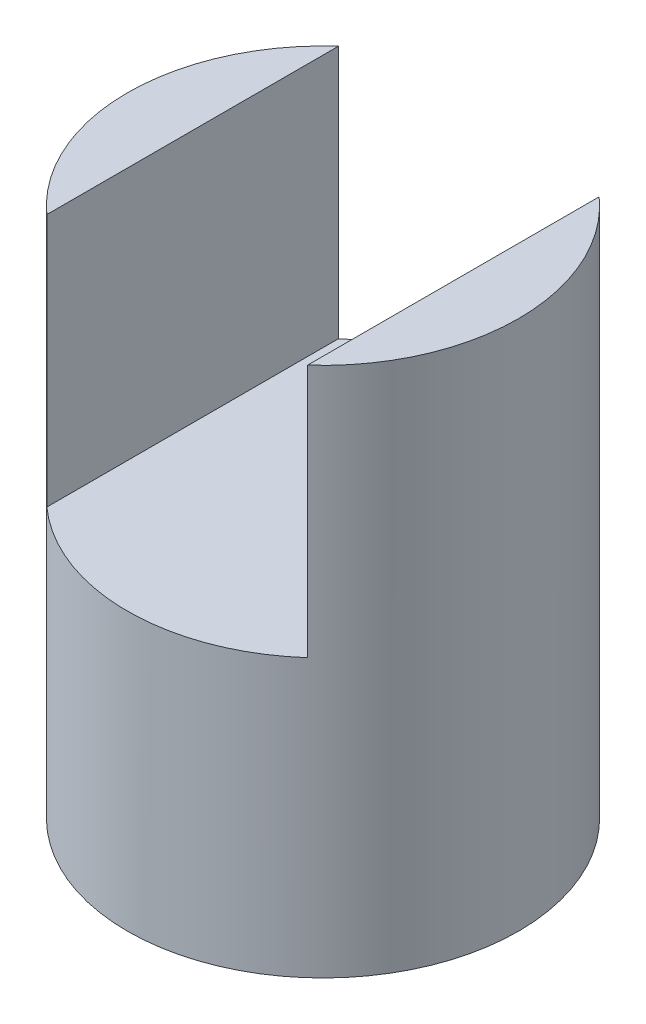
ISO-10303-21;
HEADER;
FILE_DESCRIPTION(('STEP AP214'),'2;1');
FILE_NAME('part.step','',(''),(''),'','','');
FILE_SCHEMA(('AUTOMOTIVE_DESIGN { 1 0 10303 214 1 1 1 1 }'));
ENDSEC;
DATA;
#1=APPLICATION_CONTEXT('core data for automotive mechanical design processes');
#2=APPLICATION_PROTOCOL_DEFINITION('international standard','automotive_design',2000,#1);
#3=PRODUCT_CONTEXT('',#1,'mechanical');
#4=PRODUCT('Part','Part','',(#3));
#5=PRODUCT_RELATED_PRODUCT_CATEGORY('part','',(#4));
#6=PRODUCT_DEFINITION_FORMATION('','',#4);
#7=PRODUCT_DEFINITION_CONTEXT('part definition',#1,'design');
#8=PRODUCT_DEFINITION('design','',#6,#7);
#9=PRODUCT_DEFINITION_SHAPE('','',#8);
#10=(LENGTH_UNIT() NAMED_UNIT(*) SI_UNIT(.MILLI.,.METRE.));
#11=(NAMED_UNIT(*) PLANE_ANGLE_UNIT() SI_UNIT($,.RADIAN.));
#12=(NAMED_UNIT(*) SI_UNIT($,.STERADIAN.) SOLID_ANGLE_UNIT());
#13=UNCERTAINTY_MEASURE_WITH_UNIT(LENGTH_MEASURE(1.E-05),#10,'distance_accuracy_value','');
#14=(GEOMETRIC_REPRESENTATION_CONTEXT(3) GLOBAL_UNCERTAINTY_ASSIGNED_CONTEXT((#13)) GLOBAL_UNIT_ASSIGNED_CONTEXT((#10,
#11,#12)) REPRESENTATION_CONTEXT('',''));
#15=CARTESIAN_POINT('',(0.,0.,0.));
#16=DIRECTION('',(0.,0.,1.));
#17=DIRECTION('',(1.,0.,0.));
#18=AXIS2_PLACEMENT_3D('',#15,#16,#17);
#19=CARTESIAN_POINT('',(0.,25.8375,0.));
#20=DIRECTION('',(0.,1.,0.));
#21=DIRECTION('',(0.,0.,1.));
#22=AXIS2_PLACEMENT_3D('',#19,#20,#21);
#23=PLANE('',#22);
#24=CARTESIAN_POINT('',(0.,25.8375,0.));
#25=DIRECTION('',(0.,1.,0.));
#26=DIRECTION('',(0.,0.,1.));
#27=AXIS2_PLACEMENT_3D('',#24,#25,#26);
#28=CIRCLE('',#27,9.525);
#29=CARTESIAN_POINT('',(6.35,25.8375,7.09951582856183));
#30=VERTEX_POINT('',#29);
#31=CARTESIAN_POINT('',(6.35,25.8375,-7.09951582856183));
#32=VERTEX_POINT('',#31);
#33=EDGE_CURVE('E93',#30,#32,#28,.T.);
#34=ORIENTED_EDGE('',*,*,#33,.T.);
#35=DIRECTION('',(0.,0.,1.));
#36=VECTOR('',#35,1.);
#37=CARTESIAN_POINT('',(6.35,25.8375,0.));
#38=LINE('',#37,#36);
#39=EDGE_CURVE('E114',#32,#30,#38,.T.);
#40=ORIENTED_EDGE('',*,*,#39,.T.);
#41=EDGE_LOOP('',(#34,#40));
#42=FACE_BOUND('',#41,.T.);
#43=ADVANCED_FACE('F33',(#42),#23,.T.);
#44=CARTESIAN_POINT('',(0.,12.5,0.));
#45=DIRECTION('',(0.,-1.,0.));
#46=DIRECTION('',(0.,0.,-1.));
#47=AXIS2_PLACEMENT_3D('',#44,#45,#46);
#48=CYLINDRICAL_SURFACE('',#47,9.525);
#49=CARTESIAN_POINT('',(0.,12.357,-9.525));
#50=CARTESIAN_POINT('',(-0.133261820204518,12.3569963666475,-9.52499778717324));
#51=CARTESIAN_POINT('',(-0.266563888254122,12.345923487818,-9.52217555562449));
#52=CARTESIAN_POINT('',(-0.529343744690257,12.3019932193088,-9.51119070146297));
#53=CARTESIAN_POINT('',(-0.658819388694377,12.2691238476336,-9.50302514154162));
#54=CARTESIAN_POINT('',(-0.910113998559056,12.1827258488965,-9.48225726422134));
#55=CARTESIAN_POINT('',(-1.03194208290701,12.1292223904438,-9.46966035363948));
#56=CARTESIAN_POINT('',(-1.2648940468201,12.0031644667772,-9.44136933264668));
#57=CARTESIAN_POINT('',(-1.3760174950987,11.9306092344116,-9.42567509752305));
#58=CARTESIAN_POINT('',(-1.58675101933615,11.7668900725829,-9.39252107737622));
#59=CARTESIAN_POINT('',(-1.68610299791785,11.6753995486903,-9.37503346995957));
#60=CARTESIAN_POINT('',(-1.86822958547711,11.4771059096114,-9.34044728516457));
#61=CARTESIAN_POINT('',(-1.95100227331816,11.3703010223205,-9.32334875307384));
#62=CARTESIAN_POINT('',(-2.09884319961464,11.1423954826944,-9.2911953873321));
#63=CARTESIAN_POINT('',(-2.16362112137369,11.0211010731295,-9.27617583277275));
#64=CARTESIAN_POINT('',(-2.27176615073476,10.7689020154725,-9.2502873960732));
#65=CARTESIAN_POINT('',(-2.31513678263942,10.637998953341,-9.23941783078308));
#66=CARTESIAN_POINT('',(-2.37835250981349,10.3731405174948,-9.22334627111998));
#67=CARTESIAN_POINT('',(-2.39866243654377,10.2393030320731,-9.21803247111408));
#68=CARTESIAN_POINT('',(-2.41662836661146,9.97002309996907,-9.21333954723218));
#69=CARTESIAN_POINT('',(-2.41428816103677,9.83458092566332,-9.21395943020004));
#70=CARTESIAN_POINT('',(-2.38739076502928,9.56951155489628,-9.22096341330412));
#71=CARTESIAN_POINT('',(-2.36338912946215,9.43982357872974,-9.22720336631047));
#72=CARTESIAN_POINT('',(-2.29473711857614,9.18637776145794,-9.24451447182673));
#73=CARTESIAN_POINT('',(-2.25008523709681,9.06262035363542,-9.25558597673069));
#74=CARTESIAN_POINT('',(-2.14093087229813,8.82306712932506,-9.28144392325374));
#75=CARTESIAN_POINT('',(-2.07622810930454,8.70736675526324,-9.29626755647747));
#76=CARTESIAN_POINT('',(-1.92894865586508,8.48826716968607,-9.32793871063535));
#77=CARTESIAN_POINT('',(-1.84636876065894,8.38487016890287,-9.34478659420728));
#78=CARTESIAN_POINT('',(-1.66280871445836,8.1901305575634,-9.3792135017611));
#79=CARTESIAN_POINT('',(-1.5613601861048,8.09923009813413,-9.39679948169775));
#80=CARTESIAN_POINT('',(-1.3444475965386,7.93564686589366,-9.43027626394755));
#81=CARTESIAN_POINT('',(-1.22898308445703,7.86296467936209,-9.44616701169722));
#82=CARTESIAN_POINT('',(-0.986674777222378,7.73771256101569,-9.47454545618715));
#83=CARTESIAN_POINT('',(-0.859791477125699,7.68521604560307,-9.48702068401246));
#84=CARTESIAN_POINT('',(-0.5986139778207,7.60242206293592,-9.50707191189444));
#85=CARTESIAN_POINT('',(-0.464321241001308,7.57212023188555,-9.51464887498636));
#86=CARTESIAN_POINT('',(-0.195915909627453,7.53525473046011,-9.52390673064367));
#87=CARTESIAN_POINT('',(-0.0618910228812851,7.52808913422382,-9.52573709436771));
#88=CARTESIAN_POINT('',(0.205443387655582,7.53604636527785,-9.52372202444571));
#89=CARTESIAN_POINT('',(0.338752976540512,7.55116712869411,-9.51987711636982));
#90=CARTESIAN_POINT('',(0.598769891396268,7.60277215554685,-9.50703945957878));
#91=CARTESIAN_POINT('',(0.725546957590725,7.63892660486176,-9.49812623125672));
#92=CARTESIAN_POINT('',(0.971229011334961,7.73119476548142,-9.47615771614934));
#93=CARTESIAN_POINT('',(1.09013319025598,7.78731052326324,-9.46310200468242));
#94=CARTESIAN_POINT('',(1.31907816366058,7.91906511345894,-9.4339402357856));
#95=CARTESIAN_POINT('',(1.42891937765489,7.99503919378199,-9.41778320532077));
#96=CARTESIAN_POINT('',(1.63450689029486,8.16392668154675,-9.38428900787904));
#97=CARTESIAN_POINT('',(1.73025068219546,8.25684309504475,-9.36695163181757));
#98=CARTESIAN_POINT('',(1.90741706643183,8.45977543520778,-9.33251037232561));
#99=CARTESIAN_POINT('',(1.98841691250713,8.57016394499783,-9.31542344364784));
#100=CARTESIAN_POINT('',(2.13074406616557,8.80332042926154,-9.28390484638266));
#101=CARTESIAN_POINT('',(2.19207224073659,8.92608785784664,-9.26947306078733));
#102=CARTESIAN_POINT('',(2.2928565349253,9.17986539617864,-9.24505944093763));
#103=CARTESIAN_POINT('',(2.33244205362674,9.31082145798145,-9.23505135072841));
#104=CARTESIAN_POINT('',(2.38895238323824,9.57782346217126,-9.22059641802187));
#105=CARTESIAN_POINT('',(2.40588230956493,9.71386824843918,-9.21614832014627));
#106=CARTESIAN_POINT('',(2.41632821996475,9.98287903357174,-9.21341450434409));
#107=CARTESIAN_POINT('',(2.41052059135574,10.1158173732972,-9.21495075943575));
#108=CARTESIAN_POINT('',(2.37720836550568,10.3787528499133,-9.22359992925301));
#109=CARTESIAN_POINT('',(2.34970422719062,10.5087500489553,-9.2307127260232));
#110=CARTESIAN_POINT('',(2.27415369262479,10.761355069886,-9.24961298012439));
#111=CARTESIAN_POINT('',(2.22623737784595,10.884004167804,-9.26137080203738));
#112=CARTESIAN_POINT('',(2.11132510428059,11.1196110418672,-9.28823975252158));
#113=CARTESIAN_POINT('',(2.04432642935662,11.2325674353955,-9.30335135839471));
#114=CARTESIAN_POINT('',(1.89104458183104,11.4488432419423,-9.33573012029911));
#115=CARTESIAN_POINT('',(1.80429358620498,11.551824133794,-9.35304411580009));
#116=CARTESIAN_POINT('',(1.61487702952074,11.7419868272075,-9.38760081153236));
#117=CARTESIAN_POINT('',(1.51220767874762,11.8291648558012,-9.40484349377975));
#118=CARTESIAN_POINT('',(1.29154727906688,11.9868423276571,-9.43770043863061));
#119=CARTESIAN_POINT('',(1.17330521505795,12.0569986980251,-9.4532781405964));
#120=CARTESIAN_POINT('',(0.926319990404052,12.1763263794584,-9.48066159942391));
#121=CARTESIAN_POINT('',(0.797584278930028,12.2255124249199,-9.49247000323975));
#122=CARTESIAN_POINT('',(0.557604176316797,12.2943736984106,-9.50928100573507));
#123=CARTESIAN_POINT('',(0.447482659799328,12.317807074402,-9.51513466380738));
#124=CARTESIAN_POINT('',(0.224916861953324,12.3491211405329,-9.52299494190154));
#125=CARTESIAN_POINT('',(0.112472765917535,12.3570030665438,-9.5250018676223));
#126=CARTESIAN_POINT('',(0.,12.357,-9.525));
#127=B_SPLINE_CURVE_WITH_KNOTS('',3,(#49,#50,#51,#52,#53,#54,#55,#56,#57,#58,#59,#60,#61,#62,
#63,#64,#65,#66,#67,#68,#69,#70,#71,#72,#73,#74,#75,#76,#77,#78,#79,#80,#81,#82,#83,#84,#85,#86,
#87,#88,#89,#90,#91,#92,#93,#94,#95,#96,#97,#98,#99,#100,#101,#102,#103,#104,#105,#106,#107,
#108,#109,#110,#111,#112,#113,#114,#115,#116,#117,#118,#119,#120,#121,#122,#123,#124,#125,#126),
.UNSPECIFIED.,.T.,.F.,(4,2,2,2,2,2,2,2,2,2,2,2,2,2,2,2,2,2,2,2,2,2,2,2,2,2,2,2,2,2,2,2,2,2,2,2,
2,2,4),(0.,0.399373232126286,0.798966190406954,1.19807327539704,1.59719643357124,
2.00388333762246,2.41061733956571,2.82357562509542,3.23646590221199,3.6408770338391,
4.04522047793106,4.43947945808103,4.83376719870979,5.23212767569708,5.63055962435849,
6.04066985662746,6.45079328490105,6.86239455516209,7.27391487692292,7.67463875465516,
8.07532552486213,8.4698925647573,8.86450006819397,9.26625593120789,9.66808314673164,
10.0800584569097,10.4920156076399,10.9014937145017,11.3108793495043,11.7081806329634,
12.1054735129049,12.5002715576518,12.8951258251147,13.3005400412501,13.7060509237909,
14.1191590545531,14.5319764425328,14.8690736102356,15.2061439877956),.UNSPECIFIED.);
#128=CARTESIAN_POINT('',(0.,12.357,-9.525));
#129=VERTEX_POINT('',#128);
#130=EDGE_CURVE('E88',#129,#129,#127,.T.);
#131=ORIENTED_EDGE('',*,*,#130,.T.);
#132=EDGE_LOOP('',(#131));
#133=FACE_BOUND('',#132,.T.);
#134=CARTESIAN_POINT('',(0.,0.,0.));
#135=DIRECTION('',(0.,1.,0.));
#136=DIRECTION('',(0.,0.,1.));
#137=AXIS2_PLACEMENT_3D('',#134,#135,#136);
#138=CIRCLE('',#137,9.525);
#139=CARTESIAN_POINT('',(0.,0.,9.525));
#140=VERTEX_POINT('',#139);
#141=EDGE_CURVE('E111',#140,#140,#138,.T.);
#142=ORIENTED_EDGE('',*,*,#141,.T.);
#143=EDGE_LOOP('',(#142));
#144=FACE_BOUND('',#143,.T.);
#145=CARTESIAN_POINT('',(-6.35,25.8375,-7.09951582856183));
#146=VERTEX_POINT('',#145);
#147=CARTESIAN_POINT('',(-6.35,25.8375,7.09951582856183));
#148=VERTEX_POINT('',#147);
#149=EDGE_CURVE('E103',#146,#148,#28,.T.);
#150=ORIENTED_EDGE('',*,*,#149,.F.);
#151=DIRECTION('',(0.,-1.,0.));
#152=VECTOR('',#151,1.);
#153=CARTESIAN_POINT('',(-6.35,12.5,-7.09951582856183));
#154=LINE('',#153,#152);
#155=CARTESIAN_POINT('',(-6.35,13.5,-7.09951582856183));
#156=VERTEX_POINT('',#155);
#157=EDGE_CURVE('E100',#146,#156,#154,.T.);
#158=ORIENTED_EDGE('',*,*,#157,.T.);
#159=CARTESIAN_POINT('',(0.,13.5,0.));
#160=DIRECTION('',(0.,1.,0.));
#161=DIRECTION('',(0.,0.,1.));
#162=AXIS2_PLACEMENT_3D('',#159,#160,#161);
#163=CIRCLE('',#162,9.525);
#164=CARTESIAN_POINT('',(6.35,13.5,-7.09951582856183));
#165=VERTEX_POINT('',#164);
#166=EDGE_CURVE('E11',#165,#156,#163,.T.);
#167=ORIENTED_EDGE('',*,*,#166,.F.);
#168=DIRECTION('',(0.,-1.,0.));
#169=VECTOR('',#168,1.);
#170=CARTESIAN_POINT('',(6.35,12.5,-7.09951582856183));
#171=LINE('',#170,#169);
#172=EDGE_CURVE('E87',#32,#165,#171,.T.);
#173=ORIENTED_EDGE('',*,*,#172,.F.);
#174=ORIENTED_EDGE('',*,*,#33,.F.);
#175=DIRECTION('',(0.,-1.,0.));
#176=VECTOR('',#175,1.);
#177=CARTESIAN_POINT('',(6.35,12.5,7.09951582856183));
#178=LINE('',#177,#176);
#179=CARTESIAN_POINT('',(6.35,13.5,7.09951582856184));
#180=VERTEX_POINT('',#179);
#181=EDGE_CURVE('E54',#180,#30,#178,.F.);
#182=ORIENTED_EDGE('',*,*,#181,.F.);
#183=CARTESIAN_POINT('',(-6.35,13.5,7.09951582856183));
#184=VERTEX_POINT('',#183);
#185=EDGE_CURVE('E47',#184,#180,#163,.T.);
#186=ORIENTED_EDGE('',*,*,#185,.F.);
#187=DIRECTION('',(0.,-1.,0.));
#188=VECTOR('',#187,1.);
#189=CARTESIAN_POINT('',(-6.35,12.5,7.09951582856183));
#190=LINE('',#189,#188);
#191=EDGE_CURVE('E95',#184,#148,#190,.F.);
#192=ORIENTED_EDGE('',*,*,#191,.T.);
#193=EDGE_LOOP('',(#150,#158,#167,#173,#174,#182,#186,#192));
#194=FACE_BOUND('',#193,.T.);
#195=ADVANCED_FACE('F35',(#133,#144,#194),#48,.T.);
#196=CARTESIAN_POINT('',(0.,0.,0.));
#197=DIRECTION('',(0.,1.,0.));
#198=DIRECTION('',(0.,0.,1.));
#199=AXIS2_PLACEMENT_3D('',#196,#197,#198);
#200=PLANE('',#199);
#201=CARTESIAN_POINT('',(0.,0.,0.));
#202=DIRECTION('',(0.,1.,0.));
#203=DIRECTION('',(0.,0.,1.));
#204=AXIS2_PLACEMENT_3D('',#201,#202,#203);
#205=CIRCLE('',#204,3.);
#206=CARTESIAN_POINT('',(0.,0.,3.));
#207=VERTEX_POINT('',#206);
#208=EDGE_CURVE('E108',#207,#207,#205,.F.);
#209=ORIENTED_EDGE('',*,*,#208,.F.);
#210=EDGE_LOOP('',(#209));
#211=FACE_BOUND('',#210,.T.);
#212=ORIENTED_EDGE('',*,*,#141,.F.);
#213=EDGE_LOOP('',(#212));
#214=FACE_BOUND('',#213,.T.);
#215=ADVANCED_FACE('F139',(#211,#214),#200,.F.);
#216=CARTESIAN_POINT('',(0.,-0.000999999999999265,0.));
#217=DIRECTION('',(0.,1.,0.));
#218=DIRECTION('',(0.,0.,1.));
#219=AXIS2_PLACEMENT_3D('',#216,#217,#218);
#220=CYLINDRICAL_SURFACE('',#219,3.);
#221=CARTESIAN_POINT('',(2.413,9.944,-1.78253499264391));
#222=CARTESIAN_POINT('',(2.41299430743445,9.85408031783159,-1.78254851108404));
#223=CARTESIAN_POINT('',(2.40791485505805,9.76400432740654,-1.78948097817773));
#224=CARTESIAN_POINT('',(2.38808345058082,9.58670929452183,-1.81584842282776));
#225=CARTESIAN_POINT('',(2.37329938863633,9.49950074903126,-1.83532490097093));
#226=CARTESIAN_POINT('',(2.32838878000464,9.29975936602549,-1.89217193978176));
#227=CARTESIAN_POINT('',(2.29468610088641,9.18917226927371,-1.9334342456613));
#228=CARTESIAN_POINT('',(2.21379961347961,8.9772491117013,-2.02555003805021));
#229=CARTESIAN_POINT('',(2.16657656353706,8.87594112910571,-2.07643129450142));
#230=CARTESIAN_POINT('',(2.07665948749543,8.71283147539752,-2.16567768741941));
#231=CARTESIAN_POINT('',(2.03719773883297,8.64861183661053,-2.20295744482445));
#232=CARTESIAN_POINT('',(1.95267575798989,8.52439544055459,-2.2782153354572));
#233=CARTESIAN_POINT('',(1.90761347086337,8.46440024603976,-2.31619372064443));
#234=CARTESIAN_POINT('',(1.76423363773395,8.290961367576,-2.42945509221245));
#235=CARTESIAN_POINT('',(1.65758179162862,8.18380900224993,-2.50421259442698));
#236=CARTESIAN_POINT('',(1.44615979012903,8.00851841938569,-2.63071747154032));
#237=CARTESIAN_POINT('',(1.34525258253042,7.9368609819688,-2.68408107520287));
#238=CARTESIAN_POINT('',(1.13028181937375,7.80843391217924,-2.78142252711402));
#239=CARTESIAN_POINT('',(1.01623920198195,7.75164104560873,-2.82541500270635));
#240=CARTESIAN_POINT('',(0.796428887883766,7.66366942276475,-2.89425708531859));
#241=CARTESIAN_POINT('',(0.692345870978515,7.62982363927268,-2.92105872326036));
#242=CARTESIAN_POINT('',(0.478397743977263,7.57633533224658,-2.96361284104196));
#243=CARTESIAN_POINT('',(0.368535854846742,7.55668498474626,-2.97937140724517));
#244=CARTESIAN_POINT('',(0.145659147012708,7.53278611396211,-2.99855495660367));
#245=CARTESIAN_POINT('',(0.032634554297803,7.52859228995057,-3.0019361369989));
#246=CARTESIAN_POINT('',(-0.192544812149895,7.53605776322155,-2.99593254359603));
#247=CARTESIAN_POINT('',(-0.304699555057349,7.54771761976126,-2.98654731944803));
#248=CARTESIAN_POINT('',(-0.518470111959467,7.58500060443994,-2.95672013379574));
#249=CARTESIAN_POINT('',(-0.620324247576275,7.6098041626115,-2.93692762333519));
#250=CARTESIAN_POINT('',(-0.817943049723857,7.67149819299224,-2.88813780009708));
#251=CARTESIAN_POINT('',(-0.91370615744772,7.70839174451151,-2.85913814232632));
#252=CARTESIAN_POINT('',(-1.10643203783422,7.7967539879367,-2.79056349046066));
#253=CARTESIAN_POINT('',(-1.20264250067165,7.84927525014609,-2.75024496128841));
#254=CARTESIAN_POINT('',(-1.38502722464961,7.96512174879347,-2.66306875686147));
#255=CARTESIAN_POINT('',(-1.47119606267212,8.02845277810947,-2.61620757791065));
#256=CARTESIAN_POINT('',(-1.64983831002843,8.17852810953549,-2.50819701693069));
#257=CARTESIAN_POINT('',(-1.73993915312148,8.26740667235616,-2.44609539175895));
#258=CARTESIAN_POINT('',(-1.90483683136307,8.45738544793513,-2.31999399168735));
#259=CARTESIAN_POINT('',(-1.97961384780714,8.55850122205725,-2.25599187973017));
#260=CARTESIAN_POINT('',(-2.10771350648034,8.7635406277629,-2.13648074066135));
#261=CARTESIAN_POINT('',(-2.16231111802916,8.86651397182376,-2.0807100023959));
#262=CARTESIAN_POINT('',(-2.25713849785662,9.08273867744617,-1.97742567724112));
#263=CARTESIAN_POINT('',(-2.29739963024274,9.19596691446633,-1.92989418371491));
#264=CARTESIAN_POINT('',(-2.35131845024615,9.39542837169281,-1.86347505996856));
#265=CARTESIAN_POINT('',(-2.3693590896359,9.47900499684702,-1.84027885101359));
#266=CARTESIAN_POINT('',(-2.39654640379946,9.64977107904827,-1.80473757834436));
#267=CARTESIAN_POINT('',(-2.4057135232916,9.73695174632916,-1.79236757722895));
#268=CARTESIAN_POINT('',(-2.4144253969145,9.91327334449569,-1.78062290254388));
#269=CARTESIAN_POINT('',(-2.41390927736139,10.0024231550012,-1.78133044051318));
#270=CARTESIAN_POINT('',(-2.40315631476085,10.1790988187317,-1.79580235552103));
#271=CARTESIAN_POINT('',(-2.39290621145667,10.2666222906031,-1.80958454365978));
#272=CARTESIAN_POINT('',(-2.35999209766829,10.4584467316864,-1.85237990449067));
#273=CARTESIAN_POINT('',(-2.33491836229512,10.5616619856865,-1.88427854935845));
#274=CARTESIAN_POINT('',(-2.27301708574988,10.7606347962757,-1.95849789456295));
#275=CARTESIAN_POINT('',(-2.23615405643569,10.8563687357486,-2.00084997283333));
#276=CARTESIAN_POINT('',(-2.16302478034027,11.0161236320146,-2.07928185065524));
#277=CARTESIAN_POINT('',(-2.12912757853383,11.0818867773499,-2.11410204292512));
#278=CARTESIAN_POINT('',(-2.05589604106465,11.2094137257665,-2.18538365975819));
#279=CARTESIAN_POINT('',(-2.01655937219534,11.2711757958409,-2.22184578406189));
#280=CARTESIAN_POINT('',(-1.93257336951637,11.3907431980507,-2.29527172470882));
#281=CARTESIAN_POINT('',(-1.88792036819741,11.4485457548738,-2.33223587161903));
#282=CARTESIAN_POINT('',(-1.79340091016876,11.5600550934517,-2.40568283403059));
#283=CARTESIAN_POINT('',(-1.7435317765776,11.6137597475,-2.44216539146097));
#284=CARTESIAN_POINT('',(-1.58435087623979,11.7701247788973,-2.55077221093352));
#285=CARTESIAN_POINT('',(-1.46675739675375,11.8661801045317,-2.62086837226595));
#286=CARTESIAN_POINT('',(-1.27522019214263,11.9939414591368,-2.71641699735606));
#287=CARTESIAN_POINT('',(-1.20890975466684,12.0337826360301,-2.74664666798879));
#288=CARTESIAN_POINT('',(-1.07145509098417,12.1074763701436,-2.8031223524527));
#289=CARTESIAN_POINT('',(-1.00031360171925,12.1413322796688,-2.82937059507553));
#290=CARTESIAN_POINT('',(-0.827433751507296,12.2132557034428,-2.88552966518416));
#291=CARTESIAN_POINT('',(-0.723829446901857,12.248521524972,-2.91341002475666));
#292=CARTESIAN_POINT('',(-0.510610596478723,12.3049295573328,-2.95823010410423));
#293=CARTESIAN_POINT('',(-0.401000735477447,12.3260826121823,-2.97517822369975));
#294=CARTESIAN_POINT('',(-0.178231721381846,12.3530306055227,-2.99679714910096));
#295=CARTESIAN_POINT('',(-0.0650603272508413,12.3587649451886,-3.00141951147537));
#296=CARTESIAN_POINT('',(0.16076046223047,12.3542860891762,-2.99781723033239));
#297=CARTESIAN_POINT('',(0.273409842051129,12.3440724220695,-2.98959220704191));
#298=CARTESIAN_POINT('',(0.488120864730354,12.309469311302,-2.96188754726469));
#299=CARTESIAN_POINT('',(0.59041592783132,12.285946741541,-2.94309654986724));
#300=CARTESIAN_POINT('',(0.789110074696381,12.2266812449872,-2.89615922585204));
#301=CARTESIAN_POINT('',(0.885507613868449,12.1909351328016,-2.8680104607009));
#302=CARTESIAN_POINT('',(1.07899256438706,12.1051364598673,-2.80127640445485));
#303=CARTESIAN_POINT('',(1.17539988565041,12.054104568581,-2.76199261179301));
#304=CARTESIAN_POINT('',(1.35838314274924,11.9412327173612,-2.67675205778911));
#305=CARTESIAN_POINT('',(1.44495438446663,11.879387632444,-2.63079213400657));
#306=CARTESIAN_POINT('',(1.6244042754742,11.7328269164414,-2.52472950925042));
#307=CARTESIAN_POINT('',(1.7149915533042,11.6460174705151,-2.46365045504718));
#308=CARTESIAN_POINT('',(1.88119309981082,11.4603255829514,-2.33920868843212));
#309=CARTESIAN_POINT('',(1.95678650902517,11.3614266270926,-2.27584293752944));
#310=CARTESIAN_POINT('',(2.08927939385767,11.1570981307655,-2.15466171698097));
#311=CARTESIAN_POINT('',(2.14690153752136,11.0522092583868,-2.09672580657747));
#312=CARTESIAN_POINT('',(2.2470961520863,10.831551370987,-1.98895460258892));
#313=CARTESIAN_POINT('',(2.28969714074973,10.7158035068267,-1.93910405716193));
#314=CARTESIAN_POINT('',(2.34684220491015,10.5117309519249,-1.86914556012343));
#315=CARTESIAN_POINT('',(2.36599689021046,10.42624433921,-1.84461479530682));
#316=CARTESIAN_POINT('',(2.39496385594399,10.2513943554749,-1.80685786664069));
#317=CARTESIAN_POINT('',(2.40481210423824,10.1620473170253,-1.79358820093606));
#318=CARTESIAN_POINT('',(2.41073162463597,10.0507792385542,-1.78560159044096));
#319=CARTESIAN_POINT('',(2.41158092729565,10.0294523675631,-1.78445472778669));
#320=CARTESIAN_POINT('',(2.41271584131613,9.98675328176475,-1.78291975498661));
#321=CARTESIAN_POINT('',(2.41300135357555,9.96538105964678,-1.78253177823558));
#322=CARTESIAN_POINT('',(2.413,9.944,-1.78253499264391));
#323=B_SPLINE_CURVE_WITH_KNOTS('',3,(#221,#222,#223,#224,#225,#226,#227,#228,#229,#230,#231,
#232,#233,#234,#235,#236,#237,#238,#239,#240,#241,#242,#243,#244,#245,#246,#247,#248,#249,#250,
#251,#252,#253,#254,#255,#256,#257,#258,#259,#260,#261,#262,#263,#264,#265,#266,#267,#268,#269,
#270,#271,#272,#273,#274,#275,#276,#277,#278,#279,#280,#281,#282,#283,#284,#285,#286,#287,#288,
#289,#290,#291,#292,#293,#294,#295,#296,#297,#298,#299,#300,#301,#302,#303,#304,#305,#306,#307,
#308,#309,#310,#311,#312,#313,#314,#315,#316,#317,#318,#319,#320,#321,#322),.UNSPECIFIED.,.T.,
.F.,(4,2,2,2,2,2,2,2,2,2,2,2,2,2,2,2,2,2,2,2,2,2,2,2,2,2,2,2,2,2,2,2,2,2,2,2,2,2,2,2,2,2,2,2,2,
2,2,2,2,2,4),(0.,0.269664563763874,0.540225900370232,0.906431428525922,1.27371080120684,
1.52568802942088,1.77775798742868,2.28092709298978,2.68379348090293,3.08602635274483,
3.42264667079348,3.75908131510789,4.09670543489133,4.43434146507116,4.75304640779462,
5.07183258754489,5.42094124282901,5.77023757375612,6.19166392007547,6.61363191528356,
7.00013425524371,7.3857857673874,7.65061264135253,7.91482788767167,8.1807046766231,
8.44694418033309,8.77782272160043,9.10970679976915,9.35472636516769,9.59985135723956,
9.84514644115199,10.0905680321805,10.5889892881923,10.837797382389,11.0864656763979,
11.4237880366374,11.76085090449,12.0992365778342,12.4376322541633,12.7561737296252,
13.0747982787149,13.4213498983061,13.7680662157638,14.1852171468329,14.6029444091928,
15.0006380543956,15.3975725579911,15.6695486670438,15.9404692812302,16.0045787261475,
16.0686994390262),.UNSPECIFIED.);
#324=CARTESIAN_POINT('',(2.413,9.944,-1.78253499264391));
#325=VERTEX_POINT('',#324);
#326=EDGE_CURVE('E38',#325,#325,#323,.T.);
#327=ORIENTED_EDGE('',*,*,#326,.T.);
#328=EDGE_LOOP('',(#327));
#329=FACE_BOUND('',#328,.T.);
#330=CARTESIAN_POINT('',(0.,12.5,0.));
#331=DIRECTION('',(0.,1.,0.));
#332=DIRECTION('',(0.,0.,1.));
#333=AXIS2_PLACEMENT_3D('',#330,#331,#332);
#334=CIRCLE('',#333,3.);
#335=CARTESIAN_POINT('',(0.,12.5,3.));
#336=VERTEX_POINT('',#335);
#337=EDGE_CURVE('E105',#336,#336,#334,.F.);
#338=ORIENTED_EDGE('',*,*,#337,.F.);
#339=EDGE_LOOP('',(#338));
#340=FACE_BOUND('',#339,.T.);
#341=ORIENTED_EDGE('',*,*,#208,.T.);
#342=EDGE_LOOP('',(#341));
#343=FACE_BOUND('',#342,.T.);
#344=ADVANCED_FACE('F130',(#329,#340,#343),#220,.F.);
#345=CARTESIAN_POINT('',(0.,12.5,0.));
#346=DIRECTION('',(0.,1.,0.));
#347=DIRECTION('',(0.,0.,1.));
#348=AXIS2_PLACEMENT_3D('',#345,#346,#347);
#349=PLANE('',#348);
#350=ORIENTED_EDGE('',*,*,#337,.T.);
#351=EDGE_LOOP('',(#350));
#352=FACE_BOUND('',#351,.T.);
#353=ADVANCED_FACE('F123',(#352),#349,.F.);
#354=DIRECTION('',(0.,0.,1.));
#355=VECTOR('',#354,1.);
#356=CARTESIAN_POINT('',(-6.35,25.8375,0.));
#357=LINE('',#356,#355);
#358=EDGE_CURVE('E84',#146,#148,#357,.T.);
#359=ORIENTED_EDGE('',*,*,#358,.F.);
#360=ORIENTED_EDGE('',*,*,#149,.T.);
#361=EDGE_LOOP('',(#359,#360));
#362=FACE_BOUND('',#361,.T.);
#363=ADVANCED_FACE('F121',(#362),#23,.T.);
#364=CARTESIAN_POINT('',(-6.35,13.5,13.3375));
#365=DIRECTION('',(0.,1.,0.));
#366=DIRECTION('',(0.,0.,1.));
#367=AXIS2_PLACEMENT_3D('',#364,#365,#366);
#368=PLANE('',#367);
#369=ORIENTED_EDGE('',*,*,#166,.T.);
#370=DIRECTION('',(0.,0.,-1.));
#371=VECTOR('',#370,1.);
#372=CARTESIAN_POINT('',(-6.35,13.5,13.3375));
#373=LINE('',#372,#371);
#374=EDGE_CURVE('E81',#184,#156,#373,.T.);
#375=ORIENTED_EDGE('',*,*,#374,.F.);
#376=ORIENTED_EDGE('',*,*,#185,.T.);
#377=DIRECTION('',(0.,0.,-1.));
#378=VECTOR('',#377,1.);
#379=CARTESIAN_POINT('',(6.35,13.5,13.3375));
#380=LINE('',#379,#378);
#381=EDGE_CURVE('E80',#180,#165,#380,.T.);
#382=ORIENTED_EDGE('',*,*,#381,.T.);
#383=EDGE_LOOP('',(#369,#375,#376,#382));
#384=FACE_BOUND('',#383,.T.);
#385=ADVANCED_FACE('F79',(#384),#368,.T.);
#386=CARTESIAN_POINT('',(-6.35,13.5,13.3375));
#387=DIRECTION('',(-1.,0.,0.));
#388=DIRECTION('',(0.,0.,1.));
#389=AXIS2_PLACEMENT_3D('',#386,#387,#388);
#390=PLANE('',#389);
#391=ORIENTED_EDGE('',*,*,#358,.T.);
#392=ORIENTED_EDGE('',*,*,#191,.F.);
#393=ORIENTED_EDGE('',*,*,#374,.T.);
#394=ORIENTED_EDGE('',*,*,#157,.F.);
#395=EDGE_LOOP('',(#391,#392,#393,#394));
#396=FACE_BOUND('',#395,.T.);
#397=ADVANCED_FACE('F118',(#396),#390,.F.);
#398=CARTESIAN_POINT('',(6.35,13.5,13.3375));
#399=DIRECTION('',(-1.,0.,0.));
#400=DIRECTION('',(0.,0.,1.));
#401=AXIS2_PLACEMENT_3D('',#398,#399,#400);
#402=PLANE('',#401);
#403=ORIENTED_EDGE('',*,*,#172,.T.);
#404=ORIENTED_EDGE('',*,*,#381,.F.);
#405=ORIENTED_EDGE('',*,*,#181,.T.);
#406=ORIENTED_EDGE('',*,*,#39,.F.);
#407=EDGE_LOOP('',(#403,#404,#405,#406));
#408=FACE_BOUND('',#407,.T.);
#409=ADVANCED_FACE('F85',(#408),#402,.T.);
#410=CARTESIAN_POINT('',(0.,9.944,-13.3375));
#411=DIRECTION('',(0.,0.,1.));
#412=DIRECTION('',(1.,0.,0.));
#413=AXIS2_PLACEMENT_3D('',#410,#411,#412);
#414=CYLINDRICAL_SURFACE('',#413,2.413);
#415=ORIENTED_EDGE('',*,*,#326,.F.);
#416=EDGE_LOOP('',(#415));
#417=FACE_BOUND('',#416,.T.);
#418=ORIENTED_EDGE('',*,*,#130,.F.);
#419=EDGE_LOOP('',(#418));
#420=FACE_BOUND('',#419,.T.);
#421=ADVANCED_FACE('F155',(#417,#420),#414,.F.);
#422=CLOSED_SHELL('',(#43,#195,#215,#344,#353,#363,#385,#397,#409,#421));
#423=MANIFOLD_SOLID_BREP('B2',#422);
#424=ADVANCED_BREP_SHAPE_REPRESENTATION('',(#18,#423),#14);
#425=SHAPE_DEFINITION_REPRESENTATION(#9,#424);
ENDSEC;
END-ISO-10303-21;
